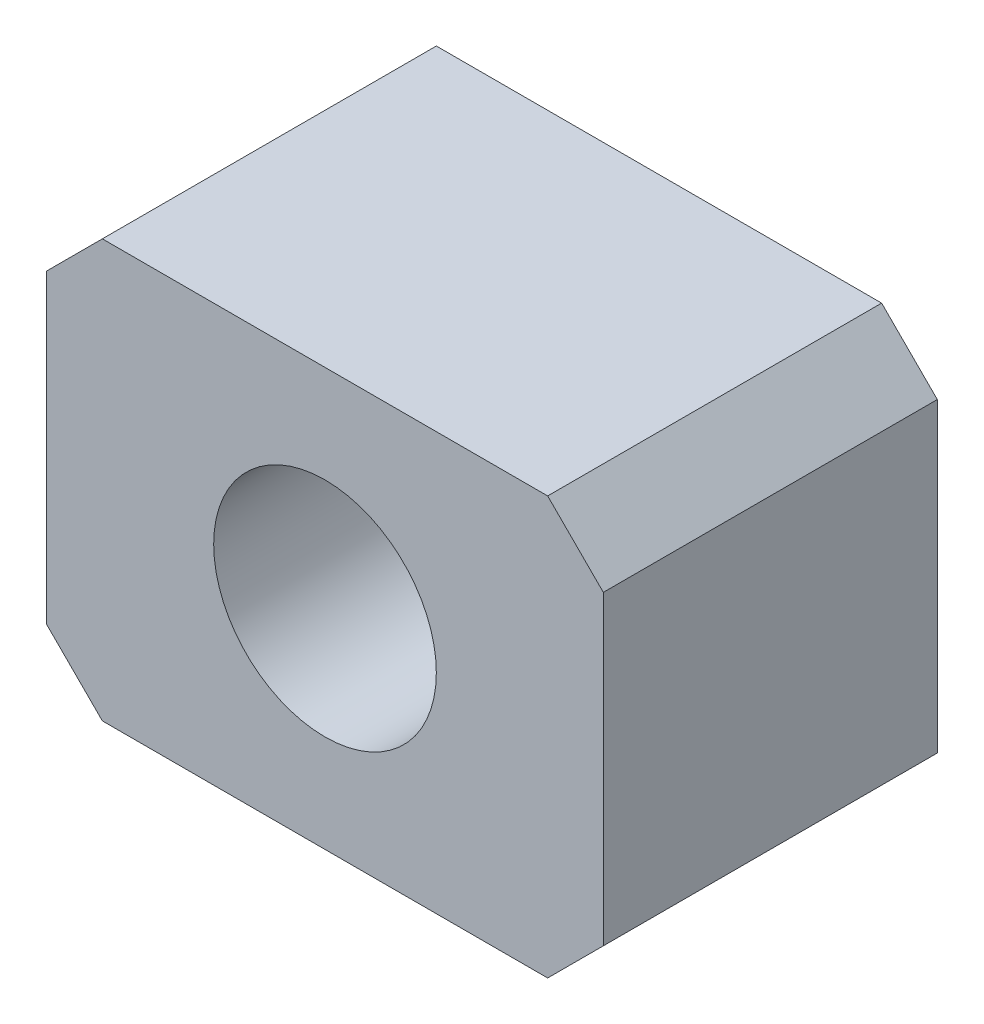
ISO-10303-21;
HEADER;
FILE_DESCRIPTION(('STEP AP214'),'2;1');
FILE_NAME('part.step','',(''),(''),'','','');
FILE_SCHEMA(('AUTOMOTIVE_DESIGN { 1 0 10303 214 1 1 1 1 }'));
ENDSEC;
DATA;
#1=APPLICATION_CONTEXT('core data for automotive mechanical design processes');
#2=APPLICATION_PROTOCOL_DEFINITION('international standard','automotive_design',2000,#1);
#3=PRODUCT_CONTEXT('',#1,'mechanical');
#4=PRODUCT('Part','Part','',(#3));
#5=PRODUCT_RELATED_PRODUCT_CATEGORY('part','',(#4));
#6=PRODUCT_DEFINITION_FORMATION('','',#4);
#7=PRODUCT_DEFINITION_CONTEXT('part definition',#1,'design');
#8=PRODUCT_DEFINITION('design','',#6,#7);
#9=PRODUCT_DEFINITION_SHAPE('','',#8);
#10=(LENGTH_UNIT() NAMED_UNIT(*) SI_UNIT(.MILLI.,.METRE.));
#11=(NAMED_UNIT(*) PLANE_ANGLE_UNIT() SI_UNIT($,.RADIAN.));
#12=(NAMED_UNIT(*) SI_UNIT($,.STERADIAN.) SOLID_ANGLE_UNIT());
#13=UNCERTAINTY_MEASURE_WITH_UNIT(LENGTH_MEASURE(1.E-05),#10,'distance_accuracy_value','');
#14=(GEOMETRIC_REPRESENTATION_CONTEXT(3) GLOBAL_UNCERTAINTY_ASSIGNED_CONTEXT((#13)) GLOBAL_UNIT_ASSIGNED_CONTEXT((#10,
#11,#12)) REPRESENTATION_CONTEXT('',''));
#15=CARTESIAN_POINT('',(0.,0.,0.));
#16=DIRECTION('',(0.,0.,1.));
#17=DIRECTION('',(1.,0.,0.));
#18=AXIS2_PLACEMENT_3D('',#15,#16,#17);
#19=CARTESIAN_POINT('',(-10.,7.5,12.));
#20=DIRECTION('',(0.,-1.,0.));
#21=DIRECTION('',(0.,0.,-1.));
#22=AXIS2_PLACEMENT_3D('',#19,#20,#21);
#23=PLANE('',#22);
#24=DIRECTION('',(-1.,0.,0.));
#25=VECTOR('',#24,1.);
#26=CARTESIAN_POINT('',(-10.,7.5,0.));
#27=LINE('',#26,#25);
#28=CARTESIAN_POINT('',(8.,7.5,0.));
#29=VERTEX_POINT('',#28);
#30=CARTESIAN_POINT('',(-8.,7.5,0.));
#31=VERTEX_POINT('',#30);
#32=EDGE_CURVE('E125',#29,#31,#27,.T.);
#33=ORIENTED_EDGE('',*,*,#32,.T.);
#34=DIRECTION('',(0.,0.,1.));
#35=VECTOR('',#34,1.);
#36=CARTESIAN_POINT('',(-8.,7.5,12.));
#37=LINE('',#36,#35);
#38=CARTESIAN_POINT('',(-8.,7.5,12.));
#39=VERTEX_POINT('',#38);
#40=EDGE_CURVE('E103',#31,#39,#37,.T.);
#41=ORIENTED_EDGE('',*,*,#40,.T.);
#42=DIRECTION('',(-1.,0.,0.));
#43=VECTOR('',#42,1.);
#44=CARTESIAN_POINT('',(-10.,7.5,12.));
#45=LINE('',#44,#43);
#46=CARTESIAN_POINT('',(8.,7.5,12.));
#47=VERTEX_POINT('',#46);
#48=EDGE_CURVE('E135',#47,#39,#45,.T.);
#49=ORIENTED_EDGE('',*,*,#48,.F.);
#50=DIRECTION('',(0.,0.,-1.));
#51=VECTOR('',#50,1.);
#52=CARTESIAN_POINT('',(8.,7.5,12.));
#53=LINE('',#52,#51);
#54=EDGE_CURVE('E108',#47,#29,#53,.T.);
#55=ORIENTED_EDGE('',*,*,#54,.T.);
#56=EDGE_LOOP('',(#33,#41,#49,#55));
#57=FACE_BOUND('',#56,.T.);
#58=ADVANCED_FACE('F32',(#57),#23,.F.);
#59=CARTESIAN_POINT('',(-10.,7.5,12.));
#60=DIRECTION('',(1.,0.,0.));
#61=DIRECTION('',(0.,1.,0.));
#62=AXIS2_PLACEMENT_3D('',#59,#60,#61);
#63=PLANE('',#62);
#64=DIRECTION('',(0.,-1.,0.));
#65=VECTOR('',#64,1.);
#66=CARTESIAN_POINT('',(-10.,7.5,12.));
#67=LINE('',#66,#65);
#68=CARTESIAN_POINT('',(-10.,5.5,12.));
#69=VERTEX_POINT('',#68);
#70=CARTESIAN_POINT('',(-10.,-5.49999999999999,12.));
#71=VERTEX_POINT('',#70);
#72=EDGE_CURVE('E118',#69,#71,#67,.T.);
#73=ORIENTED_EDGE('',*,*,#72,.F.);
#74=DIRECTION('',(0.,0.,-1.));
#75=VECTOR('',#74,1.);
#76=CARTESIAN_POINT('',(-10.,5.5,12.));
#77=LINE('',#76,#75);
#78=CARTESIAN_POINT('',(-10.,5.5,0.));
#79=VERTEX_POINT('',#78);
#80=EDGE_CURVE('E102',#69,#79,#77,.T.);
#81=ORIENTED_EDGE('',*,*,#80,.T.);
#82=DIRECTION('',(0.,-1.,0.));
#83=VECTOR('',#82,1.);
#84=CARTESIAN_POINT('',(-10.,7.5,0.));
#85=LINE('',#84,#83);
#86=CARTESIAN_POINT('',(-10.,-5.49999999999999,0.));
#87=VERTEX_POINT('',#86);
#88=EDGE_CURVE('E115',#79,#87,#85,.T.);
#89=ORIENTED_EDGE('',*,*,#88,.T.);
#90=DIRECTION('',(0.,0.,1.));
#91=VECTOR('',#90,1.);
#92=CARTESIAN_POINT('',(-10.,-5.49999999999999,12.));
#93=LINE('',#92,#91);
#94=EDGE_CURVE('E120',#87,#71,#93,.T.);
#95=ORIENTED_EDGE('',*,*,#94,.T.);
#96=EDGE_LOOP('',(#73,#81,#89,#95));
#97=FACE_BOUND('',#96,.T.);
#98=ADVANCED_FACE('F114',(#97),#63,.F.);
#99=CARTESIAN_POINT('',(-10.,-7.5,12.));
#100=DIRECTION('',(0.,1.,0.));
#101=DIRECTION('',(0.,0.,1.));
#102=AXIS2_PLACEMENT_3D('',#99,#100,#101);
#103=PLANE('',#102);
#104=DIRECTION('',(1.,0.,0.));
#105=VECTOR('',#104,1.);
#106=CARTESIAN_POINT('',(-10.,-7.5,12.));
#107=LINE('',#106,#105);
#108=CARTESIAN_POINT('',(-8.,-7.5,12.));
#109=VERTEX_POINT('',#108);
#110=CARTESIAN_POINT('',(7.99999999999999,-7.5,12.));
#111=VERTEX_POINT('',#110);
#112=EDGE_CURVE('E161',#109,#111,#107,.T.);
#113=ORIENTED_EDGE('',*,*,#112,.F.);
#114=DIRECTION('',(0.,0.,-1.));
#115=VECTOR('',#114,1.);
#116=CARTESIAN_POINT('',(-8.,-7.5,12.));
#117=LINE('',#116,#115);
#118=CARTESIAN_POINT('',(-8.,-7.5,0.));
#119=VERTEX_POINT('',#118);
#120=EDGE_CURVE('E154',#109,#119,#117,.T.);
#121=ORIENTED_EDGE('',*,*,#120,.T.);
#122=DIRECTION('',(1.,0.,0.));
#123=VECTOR('',#122,1.);
#124=CARTESIAN_POINT('',(-10.,-7.5,0.));
#125=LINE('',#124,#123);
#126=CARTESIAN_POINT('',(7.99999999999999,-7.5,0.));
#127=VERTEX_POINT('',#126);
#128=EDGE_CURVE('E124',#119,#127,#125,.T.);
#129=ORIENTED_EDGE('',*,*,#128,.T.);
#130=DIRECTION('',(0.,0.,1.));
#131=VECTOR('',#130,1.);
#132=CARTESIAN_POINT('',(7.99999999999999,-7.5,12.));
#133=LINE('',#132,#131);
#134=EDGE_CURVE('E152',#127,#111,#133,.T.);
#135=ORIENTED_EDGE('',*,*,#134,.T.);
#136=EDGE_LOOP('',(#113,#121,#129,#135));
#137=FACE_BOUND('',#136,.T.);
#138=ADVANCED_FACE('F159',(#137),#103,.F.);
#139=CARTESIAN_POINT('',(10.,7.5,12.));
#140=DIRECTION('',(-1.,0.,0.));
#141=DIRECTION('',(0.,-1.,0.));
#142=AXIS2_PLACEMENT_3D('',#139,#140,#141);
#143=PLANE('',#142);
#144=DIRECTION('',(0.,1.,0.));
#145=VECTOR('',#144,1.);
#146=CARTESIAN_POINT('',(10.,7.5,12.));
#147=LINE('',#146,#145);
#148=CARTESIAN_POINT('',(9.99999999999999,-5.5,12.));
#149=VERTEX_POINT('',#148);
#150=CARTESIAN_POINT('',(10.,5.49999999999999,12.));
#151=VERTEX_POINT('',#150);
#152=EDGE_CURVE('E136',#149,#151,#147,.T.);
#153=ORIENTED_EDGE('',*,*,#152,.F.);
#154=DIRECTION('',(0.,0.,-1.));
#155=VECTOR('',#154,1.);
#156=CARTESIAN_POINT('',(9.99999999999999,-5.5,12.));
#157=LINE('',#156,#155);
#158=CARTESIAN_POINT('',(9.99999999999999,-5.5,0.));
#159=VERTEX_POINT('',#158);
#160=EDGE_CURVE('E11',#149,#159,#157,.T.);
#161=ORIENTED_EDGE('',*,*,#160,.T.);
#162=DIRECTION('',(0.,1.,0.));
#163=VECTOR('',#162,1.);
#164=CARTESIAN_POINT('',(10.,7.5,0.));
#165=LINE('',#164,#163);
#166=CARTESIAN_POINT('',(10.,5.49999999999999,0.));
#167=VERTEX_POINT('',#166);
#168=EDGE_CURVE('E128',#159,#167,#165,.T.);
#169=ORIENTED_EDGE('',*,*,#168,.T.);
#170=DIRECTION('',(0.,0.,1.));
#171=VECTOR('',#170,1.);
#172=CARTESIAN_POINT('',(10.,5.49999999999999,12.));
#173=LINE('',#172,#171);
#174=EDGE_CURVE('E40',#167,#151,#173,.T.);
#175=ORIENTED_EDGE('',*,*,#174,.T.);
#176=EDGE_LOOP('',(#153,#161,#169,#175));
#177=FACE_BOUND('',#176,.T.);
#178=ADVANCED_FACE('F168',(#177),#143,.F.);
#179=CARTESIAN_POINT('',(0.,0.,12.));
#180=DIRECTION('',(0.,0.,-1.));
#181=DIRECTION('',(-1.,0.,0.));
#182=AXIS2_PLACEMENT_3D('',#179,#180,#181);
#183=PLANE('',#182);
#184=CARTESIAN_POINT('',(0.,0.,12.));
#185=DIRECTION('',(0.,0.,1.));
#186=DIRECTION('',(1.,0.,0.));
#187=AXIS2_PLACEMENT_3D('',#184,#185,#186);
#188=CIRCLE('',#187,4.);
#189=CARTESIAN_POINT('',(4.,0.,12.));
#190=VERTEX_POINT('',#189);
#191=EDGE_CURVE('E175',#190,#190,#188,.T.);
#192=ORIENTED_EDGE('',*,*,#191,.F.);
#193=EDGE_LOOP('',(#192));
#194=FACE_BOUND('',#193,.T.);
#195=ORIENTED_EDGE('',*,*,#48,.T.);
#196=DIRECTION('',(0.707106781186549,0.707106781186546,0.));
#197=VECTOR('',#196,1.);
#198=CARTESIAN_POINT('',(-10.,5.5,12.));
#199=LINE('',#198,#197);
#200=EDGE_CURVE('E150',#39,#69,#199,.F.);
#201=ORIENTED_EDGE('',*,*,#200,.T.);
#202=ORIENTED_EDGE('',*,*,#72,.T.);
#203=DIRECTION('',(-0.707106781186546,0.707106781186549,0.));
#204=VECTOR('',#203,1.);
#205=CARTESIAN_POINT('',(-8.,-7.5,12.));
#206=LINE('',#205,#204);
#207=EDGE_CURVE('E148',#71,#109,#206,.F.);
#208=ORIENTED_EDGE('',*,*,#207,.T.);
#209=ORIENTED_EDGE('',*,*,#112,.T.);
#210=DIRECTION('',(-0.707106781186548,-0.707106781186547,0.));
#211=VECTOR('',#210,1.);
#212=CARTESIAN_POINT('',(9.99999999999999,-5.5,12.));
#213=LINE('',#212,#211);
#214=EDGE_CURVE('E53',#111,#149,#213,.F.);
#215=ORIENTED_EDGE('',*,*,#214,.T.);
#216=ORIENTED_EDGE('',*,*,#152,.T.);
#217=DIRECTION('',(0.707106781186547,-0.707106781186548,0.));
#218=VECTOR('',#217,1.);
#219=CARTESIAN_POINT('',(8.,7.5,12.));
#220=LINE('',#219,#218);
#221=EDGE_CURVE('E145',#151,#47,#220,.F.);
#222=ORIENTED_EDGE('',*,*,#221,.T.);
#223=EDGE_LOOP('',(#195,#201,#202,#208,#209,#215,#216,#222));
#224=FACE_BOUND('',#223,.T.);
#225=ADVANCED_FACE('F188',(#194,#224),#183,.F.);
#226=CARTESIAN_POINT('',(0.,0.,0.));
#227=DIRECTION('',(0.,0.,-1.));
#228=DIRECTION('',(-1.,0.,0.));
#229=AXIS2_PLACEMENT_3D('',#226,#227,#228);
#230=PLANE('',#229);
#231=CARTESIAN_POINT('',(0.,0.,0.));
#232=DIRECTION('',(0.,0.,1.));
#233=DIRECTION('',(1.,0.,0.));
#234=AXIS2_PLACEMENT_3D('',#231,#232,#233);
#235=CIRCLE('',#234,4.);
#236=CARTESIAN_POINT('',(4.,0.,0.));
#237=VERTEX_POINT('',#236);
#238=EDGE_CURVE('E130',#237,#237,#235,.T.);
#239=ORIENTED_EDGE('',*,*,#238,.T.);
#240=EDGE_LOOP('',(#239));
#241=FACE_BOUND('',#240,.T.);
#242=ORIENTED_EDGE('',*,*,#88,.F.);
#243=DIRECTION('',(-0.707106781186549,-0.707106781186546,0.));
#244=VECTOR('',#243,1.);
#245=CARTESIAN_POINT('',(-7.74999999999998,7.75000000000001,0.));
#246=LINE('',#245,#244);
#247=EDGE_CURVE('E98',#79,#31,#246,.F.);
#248=ORIENTED_EDGE('',*,*,#247,.T.);
#249=ORIENTED_EDGE('',*,*,#32,.F.);
#250=DIRECTION('',(-0.707106781186547,0.707106781186548,0.));
#251=VECTOR('',#250,1.);
#252=CARTESIAN_POINT('',(7.75000000000001,7.74999999999999,0.));
#253=LINE('',#252,#251);
#254=EDGE_CURVE('E119',#29,#167,#253,.F.);
#255=ORIENTED_EDGE('',*,*,#254,.T.);
#256=ORIENTED_EDGE('',*,*,#168,.F.);
#257=DIRECTION('',(0.707106781186548,0.707106781186547,0.));
#258=VECTOR('',#257,1.);
#259=CARTESIAN_POINT('',(7.74999999999999,-7.75,0.));
#260=LINE('',#259,#258);
#261=EDGE_CURVE('E139',#159,#127,#260,.F.);
#262=ORIENTED_EDGE('',*,*,#261,.T.);
#263=ORIENTED_EDGE('',*,*,#128,.F.);
#264=DIRECTION('',(0.707106781186546,-0.707106781186549,0.));
#265=VECTOR('',#264,1.);
#266=CARTESIAN_POINT('',(-7.75000000000002,-7.74999999999999,0.));
#267=LINE('',#266,#265);
#268=EDGE_CURVE('E109',#119,#87,#267,.F.);
#269=ORIENTED_EDGE('',*,*,#268,.T.);
#270=EDGE_LOOP('',(#242,#248,#249,#255,#256,#262,#263,#269));
#271=FACE_BOUND('',#270,.T.);
#272=ADVANCED_FACE('F122',(#241,#271),#230,.T.);
#273=CARTESIAN_POINT('',(0.,0.,0.));
#274=DIRECTION('',(0.,0.,1.));
#275=DIRECTION('',(1.,0.,0.));
#276=AXIS2_PLACEMENT_3D('',#273,#274,#275);
#277=CYLINDRICAL_SURFACE('',#276,4.);
#278=ORIENTED_EDGE('',*,*,#238,.F.);
#279=EDGE_LOOP('',(#278));
#280=FACE_BOUND('',#279,.T.);
#281=ORIENTED_EDGE('',*,*,#191,.T.);
#282=EDGE_LOOP('',(#281));
#283=FACE_BOUND('',#282,.T.);
#284=ADVANCED_FACE('F182',(#280,#283),#277,.F.);
#285=CARTESIAN_POINT('',(-10.,5.5,12.));
#286=DIRECTION('',(0.707106781186546,-0.707106781186549,0.));
#287=DIRECTION('',(0.,0.,-1.));
#288=AXIS2_PLACEMENT_3D('',#285,#286,#287);
#289=PLANE('',#288);
#290=ORIENTED_EDGE('',*,*,#200,.F.);
#291=ORIENTED_EDGE('',*,*,#40,.F.);
#292=ORIENTED_EDGE('',*,*,#247,.F.);
#293=ORIENTED_EDGE('',*,*,#80,.F.);
#294=EDGE_LOOP('',(#290,#291,#292,#293));
#295=FACE_BOUND('',#294,.T.);
#296=ADVANCED_FACE('F101',(#295),#289,.F.);
#297=CARTESIAN_POINT('',(-8.,-7.5,12.));
#298=DIRECTION('',(0.707106781186549,0.707106781186546,0.));
#299=DIRECTION('',(0.,0.,-1.));
#300=AXIS2_PLACEMENT_3D('',#297,#298,#299);
#301=PLANE('',#300);
#302=ORIENTED_EDGE('',*,*,#207,.F.);
#303=ORIENTED_EDGE('',*,*,#94,.F.);
#304=ORIENTED_EDGE('',*,*,#268,.F.);
#305=ORIENTED_EDGE('',*,*,#120,.F.);
#306=EDGE_LOOP('',(#302,#303,#304,#305));
#307=FACE_BOUND('',#306,.T.);
#308=ADVANCED_FACE('F199',(#307),#301,.F.);
#309=CARTESIAN_POINT('',(9.99999999999999,-5.5,12.));
#310=DIRECTION('',(-0.707106781186547,0.707106781186548,0.));
#311=DIRECTION('',(0.,0.,-1.));
#312=AXIS2_PLACEMENT_3D('',#309,#310,#311);
#313=PLANE('',#312);
#314=ORIENTED_EDGE('',*,*,#214,.F.);
#315=ORIENTED_EDGE('',*,*,#134,.F.);
#316=ORIENTED_EDGE('',*,*,#261,.F.);
#317=ORIENTED_EDGE('',*,*,#160,.F.);
#318=EDGE_LOOP('',(#314,#315,#316,#317));
#319=FACE_BOUND('',#318,.T.);
#320=ADVANCED_FACE('F167',(#319),#313,.F.);
#321=CARTESIAN_POINT('',(8.,7.5,12.));
#322=DIRECTION('',(-0.707106781186548,-0.707106781186547,0.));
#323=DIRECTION('',(0.,0.,-1.));
#324=AXIS2_PLACEMENT_3D('',#321,#322,#323);
#325=PLANE('',#324);
#326=ORIENTED_EDGE('',*,*,#221,.F.);
#327=ORIENTED_EDGE('',*,*,#174,.F.);
#328=ORIENTED_EDGE('',*,*,#254,.F.);
#329=ORIENTED_EDGE('',*,*,#54,.F.);
#330=EDGE_LOOP('',(#326,#327,#328,#329));
#331=FACE_BOUND('',#330,.T.);
#332=ADVANCED_FACE('F34',(#331),#325,.F.);
#333=CLOSED_SHELL('',(#58,#98,#138,#178,#225,#272,#284,#296,#308,#320,#332));
#334=MANIFOLD_SOLID_BREP('B2',#333);
#335=ADVANCED_BREP_SHAPE_REPRESENTATION('',(#18,#334),#14);
#336=SHAPE_DEFINITION_REPRESENTATION(#9,#335);
ENDSEC;
END-ISO-10303-21;
